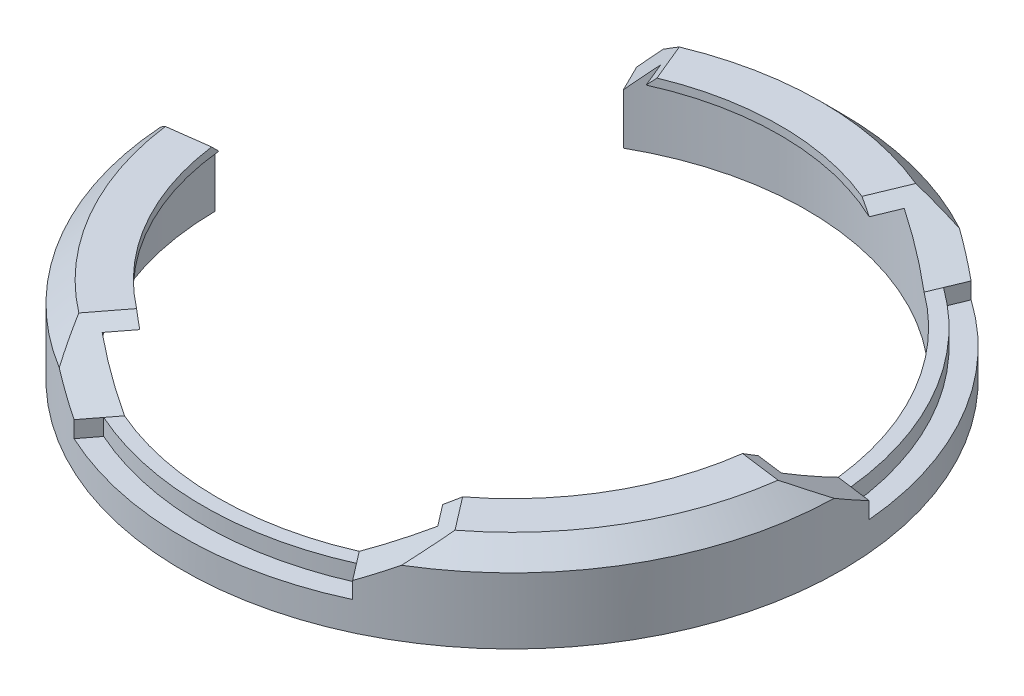
ISO-10303-21;
HEADER;
FILE_DESCRIPTION(('STEP AP214'),'2;1');
FILE_NAME('part.step','',(''),(''),'','','');
FILE_SCHEMA(('AUTOMOTIVE_DESIGN { 1 0 10303 214 1 1 1 1 }'));
ENDSEC;
DATA;
#1=APPLICATION_CONTEXT('core data for automotive mechanical design processes');
#2=APPLICATION_PROTOCOL_DEFINITION('international standard','automotive_design',2000,#1);
#3=PRODUCT_CONTEXT('',#1,'mechanical');
#4=PRODUCT('Part','Part','',(#3));
#5=PRODUCT_RELATED_PRODUCT_CATEGORY('part','',(#4));
#6=PRODUCT_DEFINITION_FORMATION('','',#4);
#7=PRODUCT_DEFINITION_CONTEXT('part definition',#1,'design');
#8=PRODUCT_DEFINITION('design','',#6,#7);
#9=PRODUCT_DEFINITION_SHAPE('','',#8);
#10=(LENGTH_UNIT() NAMED_UNIT(*) SI_UNIT(.MILLI.,.METRE.));
#11=(NAMED_UNIT(*) PLANE_ANGLE_UNIT() SI_UNIT($,.RADIAN.));
#12=(NAMED_UNIT(*) SI_UNIT($,.STERADIAN.) SOLID_ANGLE_UNIT());
#13=UNCERTAINTY_MEASURE_WITH_UNIT(LENGTH_MEASURE(1.E-05),#10,'distance_accuracy_value','');
#14=(GEOMETRIC_REPRESENTATION_CONTEXT(3) GLOBAL_UNCERTAINTY_ASSIGNED_CONTEXT((#13)) GLOBAL_UNIT_ASSIGNED_CONTEXT((#10,
#11,#12)) REPRESENTATION_CONTEXT('',''));
#15=CARTESIAN_POINT('',(0.,0.,0.));
#16=DIRECTION('',(0.,0.,1.));
#17=DIRECTION('',(1.,0.,0.));
#18=AXIS2_PLACEMENT_3D('',#15,#16,#17);
#19=CARTESIAN_POINT('',(0.,11.,0.));
#20=DIRECTION('',(0.,1.,0.));
#21=DIRECTION('',(0.,0.,1.));
#22=AXIS2_PLACEMENT_3D('',#19,#20,#21);
#23=PLANE('',#22);
#24=DIRECTION('',(0.991444861373811,0.,0.130526192220051));
#25=VECTOR('',#24,1.);
#26=CARTESIAN_POINT('',(2.26077996643632,11.,-17.1723287280254));
#27=LINE('',#26,#25);
#28=CARTESIAN_POINT('',(71.0376894548669,11.,-8.11767681753134));
#29=VERTEX_POINT('',#28);
#30=CARTESIAN_POINT('',(74.6090868747161,11.,-7.64749342733103));
#31=VERTEX_POINT('',#30);
#32=EDGE_CURVE('E199',#29,#31,#27,.T.);
#33=ORIENTED_EDGE('',*,*,#32,.T.);
#34=CARTESIAN_POINT('',(0.,11.,0.));
#35=DIRECTION('',(0.,1.,0.));
#36=DIRECTION('',(0.,0.,1.));
#37=AXIS2_PLACEMENT_3D('',#34,#35,#36);
#38=CIRCLE('',#37,75.);
#39=CARTESIAN_POINT('',(43.9274670207012,11.,-60.7896178729987));
#40=VERTEX_POINT('',#39);
#41=EDGE_CURVE('E338',#31,#40,#38,.T.);
#42=ORIENTED_EDGE('',*,*,#41,.T.);
#43=DIRECTION('',(-0.38268343236509,0.,0.923879532511287));
#44=VECTOR('',#43,1.);
#45=CARTESIAN_POINT('',(43.3639283179295,11.,-59.429115093845));
#46=LINE('',#45,#44);
#47=CARTESIAN_POINT('',(42.5489590711276,11.,-57.461605285299));
#48=VERTEX_POINT('',#47);
#49=EDGE_CURVE('E202',#40,#48,#46,.T.);
#50=ORIENTED_EDGE('',*,*,#49,.T.);
#51=CARTESIAN_POINT('',(0.,11.,0.));
#52=DIRECTION('',(0.,1.,0.));
#53=DIRECTION('',(0.,0.,1.));
#54=AXIS2_PLACEMENT_3D('',#51,#52,#53);
#55=CIRCLE('',#54,71.5);
#56=EDGE_CURVE('E184',#29,#48,#55,.T.);
#57=ORIENTED_EDGE('',*,*,#56,.F.);
#58=EDGE_LOOP('',(#33,#42,#50,#57));
#59=FACE_BOUND('',#58,.T.);
#60=ADVANCED_FACE('F37',(#59),#23,.T.);
#61=CARTESIAN_POINT('',(0.,11.,0.));
#62=DIRECTION('',(0.,1.,0.));
#63=DIRECTION('',(0.,0.,1.));
#64=AXIS2_PLACEMENT_3D('',#61,#62,#63);
#65=PLANE('',#64);
#66=DIRECTION('',(-0.60876142900872,0.,0.793353340291236));
#67=VECTOR('',#66,1.);
#68=CARTESIAN_POINT('',(13.7412829373892,11.,10.5440572473135));
#69=LINE('',#68,#67);
#70=CARTESIAN_POINT('',(-28.4887303837393,11.,65.5792821028304));
#71=VERTEX_POINT('',#70);
#72=CARTESIAN_POINT('',(-30.6816198540149,11.,68.4371113003297));
#73=VERTEX_POINT('',#72);
#74=EDGE_CURVE('E196',#71,#73,#69,.T.);
#75=ORIENTED_EDGE('',*,*,#74,.T.);
#76=CARTESIAN_POINT('',(0.,11.,0.));
#77=DIRECTION('',(0.,1.,0.));
#78=DIRECTION('',(0.,0.,1.));
#79=AXIS2_PLACEMENT_3D('',#76,#77,#78);
#80=CIRCLE('',#79,75.);
#81=CARTESIAN_POINT('',(30.6816198540148,11.,68.4371113003297));
#82=VERTEX_POINT('',#81);
#83=EDGE_CURVE('E343',#73,#82,#80,.T.);
#84=ORIENTED_EDGE('',*,*,#83,.T.);
#85=DIRECTION('',(-0.60876142900872,0.,-0.793353340291236));
#86=VECTOR('',#85,1.);
#87=CARTESIAN_POINT('',(29.7851592367343,11.,67.2688210781368));
#88=LINE('',#87,#86);
#89=CARTESIAN_POINT('',(28.4887303837394,11.,65.5792821028304));
#90=VERTEX_POINT('',#89);
#91=EDGE_CURVE('E192',#82,#90,#88,.T.);
#92=ORIENTED_EDGE('',*,*,#91,.T.);
#93=CARTESIAN_POINT('',(0.,11.,0.));
#94=DIRECTION('',(0.,1.,0.));
#95=DIRECTION('',(0.,0.,1.));
#96=AXIS2_PLACEMENT_3D('',#93,#94,#95);
#97=CIRCLE('',#96,71.5);
#98=EDGE_CURVE('E189',#71,#90,#97,.T.);
#99=ORIENTED_EDGE('',*,*,#98,.F.);
#100=EDGE_LOOP('',(#75,#84,#92,#99));
#101=FACE_BOUND('',#100,.T.);
#102=ADVANCED_FACE('F468',(#101),#65,.T.);
#103=CARTESIAN_POINT('',(0.,19.,0.));
#104=DIRECTION('',(0.,-1.,0.));
#105=DIRECTION('',(0.,0.,-1.));
#106=AXIS2_PLACEMENT_3D('',#103,#104,#105);
#107=CYLINDRICAL_SURFACE('',#106,80.);
#108=CARTESIAN_POINT('',(0.,0.,0.));
#109=DIRECTION('',(0.,1.,0.));
#110=DIRECTION('',(0.,0.,1.));
#111=AXIS2_PLACEMENT_3D('',#108,#109,#110);
#112=CIRCLE('',#111,80.);
#113=CARTESIAN_POINT('',(-79.9969538451337,0.,0.698122839869706));
#114=VERTEX_POINT('',#113);
#115=CARTESIAN_POINT('',(-39.3938848082776,0.,-69.6284556751919));
#116=VERTEX_POINT('',#115);
#117=EDGE_CURVE('E180',#114,#116,#112,.T.);
#118=ORIENTED_EDGE('',*,*,#117,.T.);
#119=DIRECTION('',(0.,1.,0.));
#120=VECTOR('',#119,1.);
#121=CARTESIAN_POINT('',(-39.3938848082776,-23.,-69.6284556751919));
#122=LINE('',#121,#120);
#123=CARTESIAN_POINT('',(-39.3938848082776,11.2504525275882,-69.6284556751919));
#124=VERTEX_POINT('',#123);
#125=EDGE_CURVE('E329',#116,#124,#122,.T.);
#126=ORIENTED_EDGE('',*,*,#125,.T.);
#127=CARTESIAN_POINT('',(0.,21.0000000000001,0.));
#128=DIRECTION('',(0.653281482438185,-0.707106781186551,-0.270598050073098));
#129=DIRECTION('',(-0.653281482438192,-0.707106781186544,0.2705980500731));
#130=AXIS2_PLACEMENT_3D('',#127,#128,#129);
#131=ELLIPSE('',#130,113.137084989847,80.);
#132=CARTESIAN_POINT('',(-35.1742194582713,16.,-71.8524480132818));
#133=VERTEX_POINT('',#132);
#134=EDGE_CURVE('E273',#124,#133,#131,.T.);
#135=ORIENTED_EDGE('',*,*,#134,.T.);
#136=CARTESIAN_POINT('',(0.,16.,0.));
#137=DIRECTION('',(0.,1.,0.));
#138=DIRECTION('',(0.,0.,1.));
#139=AXIS2_PLACEMENT_3D('',#136,#137,#138);
#140=CIRCLE('',#139,80.);
#141=CARTESIAN_POINT('',(38.4357945444284,15.9999999999999,-70.161882085207));
#142=VERTEX_POINT('',#141);
#143=EDGE_CURVE('E251',#133,#142,#140,.F.);
#144=ORIENTED_EDGE('',*,*,#143,.T.);
#145=CARTESIAN_POINT('',(0.,21.,0.));
#146=DIRECTION('',(0.461939766255639,0.866025403784441,0.191341716182543));
#147=DIRECTION('',(0.800103145191268,-0.499999999999995,0.331413574035593));
#148=AXIS2_PLACEMENT_3D('',#145,#146,#147);
#149=ELLIPSE('',#148,92.3760430703398,80.);
#150=CARTESIAN_POINT('',(45.8905944398684,11.,-65.5290267130187));
#151=VERTEX_POINT('',#150);
#152=EDGE_CURVE('E214',#142,#151,#149,.F.);
#153=ORIENTED_EDGE('',*,*,#152,.T.);
#154=DIRECTION('',(0.,1.,0.));
#155=VECTOR('',#154,1.);
#156=CARTESIAN_POINT('',(45.8905944398684,7.,-65.5290267130187));
#157=LINE('',#156,#155);
#158=CARTESIAN_POINT('',(45.8905944398684,7.,-65.5290267130187));
#159=VERTEX_POINT('',#158);
#160=EDGE_CURVE('E390',#159,#151,#157,.T.);
#161=ORIENTED_EDGE('',*,*,#160,.F.);
#162=CARTESIAN_POINT('',(0.,7.,0.));
#163=DIRECTION('',(0.,1.,0.));
#164=DIRECTION('',(0.,0.,1.));
#165=AXIS2_PLACEMENT_3D('',#162,#163,#164);
#166=CIRCLE('',#165,80.);
#167=CARTESIAN_POINT('',(79.6950990386775,7.,-6.97790722318564));
#168=VERTEX_POINT('',#167);
#169=EDGE_CURVE('E377',#168,#159,#166,.T.);
#170=ORIENTED_EDGE('',*,*,#169,.F.);
#171=DIRECTION('',(0.,1.,0.));
#172=VECTOR('',#171,1.);
#173=CARTESIAN_POINT('',(79.6950990386775,7.,-6.97790722318564));
#174=LINE('',#173,#172);
#175=CARTESIAN_POINT('',(79.6950990386775,11.,-6.97790722318564));
#176=VERTEX_POINT('',#175);
#177=EDGE_CURVE('E393',#168,#176,#174,.T.);
#178=ORIENTED_EDGE('',*,*,#177,.T.);
#179=CARTESIAN_POINT('',(0.,21.,0.));
#180=DIRECTION('',(-0.0652630961100247,-0.866025403784441,0.4957224306869));
#181=DIRECTION('',(0.113038998321815,-0.499999999999995,-0.858616436401264));
#182=AXIS2_PLACEMENT_3D('',#179,#180,#181);
#183=ELLIPSE('',#182,92.3760430703398,80.);
#184=CARTESIAN_POINT('',(79.9798695353317,16.,1.79456655248922));
#185=VERTEX_POINT('',#184);
#186=EDGE_CURVE('E235',#176,#185,#183,.T.);
#187=ORIENTED_EDGE('',*,*,#186,.T.);
#188=CARTESIAN_POINT('',(0.,16.,0.));
#189=DIRECTION('',(0.,1.,0.));
#190=DIRECTION('',(0.,0.,1.));
#191=AXIS2_PLACEMENT_3D('',#188,#189,#190);
#192=CIRCLE('',#191,80.);
#193=CARTESIAN_POINT('',(41.5440749909034,16.,68.3673155327178));
#194=VERTEX_POINT('',#193);
#195=EDGE_CURVE('E247',#185,#194,#192,.F.);
#196=ORIENTED_EDGE('',*,*,#195,.T.);
#197=CARTESIAN_POINT('',(0.,21.,0.));
#198=DIRECTION('',(-0.396676670145614,0.866025403784441,0.304380714504357));
#199=DIRECTION('',(-0.687064146869453,-0.499999999999995,0.52720286236567));
#200=AXIS2_PLACEMENT_3D('',#197,#198,#199);
#201=ELLIPSE('',#200,92.3760430703398,80.);
#202=CARTESIAN_POINT('',(33.8045045988091,11.,72.5069339362043));
#203=VERTEX_POINT('',#202);
#204=EDGE_CURVE('E225',#194,#203,#201,.F.);
#205=ORIENTED_EDGE('',*,*,#204,.T.);
#206=DIRECTION('',(0.,1.,0.));
#207=VECTOR('',#206,1.);
#208=CARTESIAN_POINT('',(33.8045045988091,7.,72.5069339362043));
#209=LINE('',#208,#207);
#210=CARTESIAN_POINT('',(33.8045045988091,7.,72.5069339362043));
#211=VERTEX_POINT('',#210);
#212=EDGE_CURVE('E365',#211,#203,#209,.T.);
#213=ORIENTED_EDGE('',*,*,#212,.F.);
#214=CARTESIAN_POINT('',(0.,7.,0.));
#215=DIRECTION('',(0.,1.,0.));
#216=DIRECTION('',(0.,0.,1.));
#217=AXIS2_PLACEMENT_3D('',#214,#215,#216);
#218=CIRCLE('',#217,80.);
#219=CARTESIAN_POINT('',(-33.8045045988091,7.,72.5069339362043));
#220=VERTEX_POINT('',#219);
#221=EDGE_CURVE('E342',#220,#211,#218,.T.);
#222=ORIENTED_EDGE('',*,*,#221,.F.);
#223=DIRECTION('',(0.,1.,0.));
#224=VECTOR('',#223,1.);
#225=CARTESIAN_POINT('',(-33.8045045988091,7.,72.5069339362043));
#226=LINE('',#225,#224);
#227=CARTESIAN_POINT('',(-33.8045045988091,11.,72.5069339362043));
#228=VERTEX_POINT('',#227);
#229=EDGE_CURVE('E352',#220,#228,#226,.T.);
#230=ORIENTED_EDGE('',*,*,#229,.T.);
#231=CARTESIAN_POINT('',(0.,21.,0.));
#232=DIRECTION('',(-0.396676670145614,-0.866025403784441,-0.304380714504357));
#233=DIRECTION('',(0.687064146869453,-0.499999999999995,0.52720286236567));
#234=AXIS2_PLACEMENT_3D('',#231,#232,#233);
#235=ELLIPSE('',#234,92.3760430703398,80.);
#236=CARTESIAN_POINT('',(-41.5440749909034,15.9999999999999,68.3673155327178));
#237=VERTEX_POINT('',#236);
#238=EDGE_CURVE('E206',#228,#237,#235,.T.);
#239=ORIENTED_EDGE('',*,*,#238,.T.);
#240=CARTESIAN_POINT('',(0.,15.9999999999999,0.));
#241=DIRECTION('',(0.,1.,0.));
#242=DIRECTION('',(0.,0.,1.));
#243=AXIS2_PLACEMENT_3D('',#240,#241,#242);
#244=CIRCLE('',#243,80.);
#245=CARTESIAN_POINT('',(-79.8131550327384,15.9999999999999,5.46445639748908));
#246=VERTEX_POINT('',#245);
#247=EDGE_CURVE('E112',#237,#246,#244,.F.);
#248=ORIENTED_EDGE('',*,*,#247,.T.);
#249=CARTESIAN_POINT('',(0.,21.0000000000002,0.));
#250=DIRECTION('',(-0.0922959556412576,0.707106781186544,-0.701057384649982));
#251=DIRECTION('',(-0.0922959556412567,-0.707106781186551,-0.701057384649974));
#252=AXIS2_PLACEMENT_3D('',#249,#250,#251);
#253=ELLIPSE('',#252,113.137084989848,80.);
#254=CARTESIAN_POINT('',(-79.9969538451337,11.2504525275881,0.698122839869706));
#255=VERTEX_POINT('',#254);
#256=EDGE_CURVE('E108',#246,#255,#253,.F.);
#257=ORIENTED_EDGE('',*,*,#256,.T.);
#258=DIRECTION('',(0.,1.,0.));
#259=VECTOR('',#258,1.);
#260=CARTESIAN_POINT('',(-79.9969538451337,-23.,0.698122839869706));
#261=LINE('',#260,#259);
#262=EDGE_CURVE('E94',#114,#255,#261,.T.);
#263=ORIENTED_EDGE('',*,*,#262,.F.);
#264=EDGE_LOOP('',(#118,#126,#135,#144,#153,#161,#170,#178,#187,#196,#205,#213,#222,#230,#239,
#248,#257,#263));
#265=FACE_BOUND('',#264,.T.);
#266=ADVANCED_FACE('F109',(#265),#107,.T.);
#267=CARTESIAN_POINT('',(0.,19.,0.));
#268=DIRECTION('',(0.,-1.,0.));
#269=DIRECTION('',(0.,0.,-1.));
#270=AXIS2_PLACEMENT_3D('',#267,#268,#269);
#271=CYLINDRICAL_SURFACE('',#270,71.5);
#272=DIRECTION('',(0.,1.,0.));
#273=VECTOR('',#272,1.);
#274=CARTESIAN_POINT('',(-35.2082845473981,-23.,-62.2304322597027));
#275=LINE('',#274,#273);
#276=CARTESIAN_POINT('',(-35.2082845473981,0.,-62.2304322597027));
#277=VERTEX_POINT('',#276);
#278=CARTESIAN_POINT('',(-35.2082845473981,12.2863419465319,-62.2304322597027));
#279=VERTEX_POINT('',#278);
#280=EDGE_CURVE('E68',#277,#279,#275,.T.);
#281=ORIENTED_EDGE('',*,*,#280,.F.);
#282=CARTESIAN_POINT('',(0.,0.,0.));
#283=DIRECTION('',(0.,1.,0.));
#284=DIRECTION('',(0.,0.,1.));
#285=AXIS2_PLACEMENT_3D('',#282,#283,#284);
#286=CIRCLE('',#285,71.5);
#287=CARTESIAN_POINT('',(-71.4972774990882,0.,0.623947288133549));
#288=VERTEX_POINT('',#287);
#289=EDGE_CURVE('E173',#288,#277,#286,.T.);
#290=ORIENTED_EDGE('',*,*,#289,.F.);
#291=DIRECTION('',(0.,1.,0.));
#292=VECTOR('',#291,1.);
#293=CARTESIAN_POINT('',(-71.4972774990882,-23.,0.623947288133549));
#294=LINE('',#293,#292);
#295=CARTESIAN_POINT('',(-71.4972774990882,12.2863419465319,0.623947288133549));
#296=VERTEX_POINT('',#295);
#297=EDGE_CURVE('E88',#288,#296,#294,.T.);
#298=ORIENTED_EDGE('',*,*,#297,.T.);
#299=CARTESIAN_POINT('',(0.,21.0000000000002,0.));
#300=DIRECTION('',(-0.0922959556412576,0.707106781186544,-0.701057384649982));
#301=DIRECTION('',(-0.0922959556412567,-0.707106781186551,-0.701057384649974));
#302=AXIS2_PLACEMENT_3D('',#299,#300,#301);
#303=ELLIPSE('',#302,101.116269709677,71.5);
#304=CARTESIAN_POINT('',(-71.1216218223904,19.,7.34608122422345));
#305=VERTEX_POINT('',#304);
#306=EDGE_CURVE('E119',#296,#305,#303,.T.);
#307=ORIENTED_EDGE('',*,*,#306,.T.);
#308=CARTESIAN_POINT('',(0.,19.,0.));
#309=DIRECTION('',(0.,1.,0.));
#310=DIRECTION('',(0.,0.,1.));
#311=AXIS2_PLACEMENT_3D('',#308,#309,#310);
#312=CIRCLE('',#311,71.5);
#313=CARTESIAN_POINT('',(-40.727070698328,19.,58.7669610609005));
#314=VERTEX_POINT('',#313);
#315=EDGE_CURVE('E129',#305,#314,#312,.T.);
#316=ORIENTED_EDGE('',*,*,#315,.T.);
#317=CARTESIAN_POINT('',(0.,21.,0.));
#318=DIRECTION('',(-0.396676670145614,-0.866025403784441,-0.304380714504357));
#319=DIRECTION('',(0.687064146869453,-0.499999999999995,0.52720286236567));
#320=AXIS2_PLACEMENT_3D('',#317,#318,#319);
#321=ELLIPSE('',#320,82.5610884941162,71.5);
#322=EDGE_CURVE('E212',#314,#71,#321,.F.);
#323=ORIENTED_EDGE('',*,*,#322,.T.);
#324=ORIENTED_EDGE('',*,*,#98,.T.);
#325=CARTESIAN_POINT('',(0.,21.,0.));
#326=DIRECTION('',(-0.396676670145614,0.866025403784441,0.304380714504357));
#327=DIRECTION('',(-0.687064146869453,-0.499999999999995,0.52720286236567));
#328=AXIS2_PLACEMENT_3D('',#325,#326,#327);
#329=ELLIPSE('',#328,82.5610884941162,71.5);
#330=CARTESIAN_POINT('',(40.727070698328,19.,58.7669610609005));
#331=VERTEX_POINT('',#330);
#332=EDGE_CURVE('E228',#90,#331,#329,.T.);
#333=ORIENTED_EDGE('',*,*,#332,.T.);
#334=CARTESIAN_POINT('',(71.2572165311147,19.,5.88719731602661));
#335=VERTEX_POINT('',#334);
#336=EDGE_CURVE('E168',#331,#335,#312,.T.);
#337=ORIENTED_EDGE('',*,*,#336,.T.);
#338=CARTESIAN_POINT('',(0.,21.,0.));
#339=DIRECTION('',(-0.0652630961100247,-0.866025403784441,0.4957224306869));
#340=DIRECTION('',(0.113038998321815,-0.499999999999995,-0.858616436401264));
#341=AXIS2_PLACEMENT_3D('',#338,#339,#340);
#342=ELLIPSE('',#341,82.5610884941162,71.5);
#343=EDGE_CURVE('E242',#335,#29,#342,.F.);
#344=ORIENTED_EDGE('',*,*,#343,.T.);
#345=ORIENTED_EDGE('',*,*,#56,.T.);
#346=CARTESIAN_POINT('',(0.,21.,0.));
#347=DIRECTION('',(0.461939766255639,0.866025403784441,0.191341716182543));
#348=DIRECTION('',(0.800103145191268,-0.499999999999995,0.331413574035593));
#349=AXIS2_PLACEMENT_3D('',#346,#347,#348);
#350=ELLIPSE('',#349,82.5610884941162,71.5);
#351=CARTESIAN_POINT('',(30.5301458327867,19.,-64.6541583769271));
#352=VERTEX_POINT('',#351);
#353=EDGE_CURVE('E217',#48,#352,#350,.T.);
#354=ORIENTED_EDGE('',*,*,#353,.T.);
#355=CARTESIAN_POINT('',(-29.1989179527537,19.,-65.2661718686515));
#356=VERTEX_POINT('',#355);
#357=EDGE_CURVE('E78',#352,#356,#312,.T.);
#358=ORIENTED_EDGE('',*,*,#357,.T.);
#359=CARTESIAN_POINT('',(0.,21.0000000000001,0.));
#360=DIRECTION('',(0.653281482438185,-0.707106781186551,-0.270598050073098));
#361=DIRECTION('',(-0.653281482438192,-0.707106781186544,0.2705980500731));
#362=AXIS2_PLACEMENT_3D('',#359,#360,#361);
#363=ELLIPSE('',#362,101.116269709676,71.5);
#364=EDGE_CURVE('E307',#356,#279,#363,.F.);
#365=ORIENTED_EDGE('',*,*,#364,.T.);
#366=EDGE_LOOP('',(#281,#290,#298,#307,#316,#323,#324,#333,#337,#344,#345,#354,#358,#365));
#367=FACE_BOUND('',#366,.T.);
#368=ADVANCED_FACE('F325',(#367),#271,.F.);
#369=CARTESIAN_POINT('',(0.,19.,0.));
#370=DIRECTION('',(0.,1.,0.));
#371=DIRECTION('',(0.,0.,1.));
#372=AXIS2_PLACEMENT_3D('',#369,#370,#371);
#373=PLANE('',#372);
#374=ORIENTED_EDGE('',*,*,#336,.F.);
#375=DIRECTION('',(0.60876142900872,0.,0.793353340291235));
#376=VECTOR('',#375,1.);
#377=CARTESIAN_POINT('',(-2.74825658747782,19.,2.10881144946269));
#378=LINE('',#377,#376);
#379=CARTESIAN_POINT('',(36.7650029780343,19.,53.6034938788987));
#380=VERTEX_POINT('',#379);
#381=EDGE_CURVE('E230',#331,#380,#378,.F.);
#382=ORIENTED_EDGE('',*,*,#381,.T.);
#383=CARTESIAN_POINT('',(0.,19.,0.));
#384=DIRECTION('',(0.,1.,0.));
#385=DIRECTION('',(0.,0.,1.));
#386=AXIS2_PLACEMENT_3D('',#383,#384,#385);
#387=CIRCLE('',#386,65.);
#388=CARTESIAN_POINT('',(64.8044889197471,19.,5.03767960973891));
#389=VERTEX_POINT('',#388);
#390=EDGE_CURVE('E152',#380,#389,#387,.T.);
#391=ORIENTED_EDGE('',*,*,#390,.T.);
#392=DIRECTION('',(0.991444861373811,0.,0.130526192220051));
#393=VECTOR('',#392,1.);
#394=CARTESIAN_POINT('',(0.452155993287262,19.,-3.43446574560507));
#395=LINE('',#394,#393);
#396=EDGE_CURVE('E240',#389,#335,#395,.T.);
#397=ORIENTED_EDGE('',*,*,#396,.T.);
#398=EDGE_LOOP('',(#374,#382,#391,#397));
#399=FACE_BOUND('',#398,.T.);
#400=ADVANCED_FACE('F483',(#399),#373,.F.);
#401=CARTESIAN_POINT('',(-64.6744551542293,19.,6.49729562999784));
#402=VERTEX_POINT('',#401);
#403=CARTESIAN_POINT('',(-36.7650029780343,19.,53.6034938788987));
#404=VERTEX_POINT('',#403);
#405=EDGE_CURVE('E54',#402,#404,#387,.T.);
#406=ORIENTED_EDGE('',*,*,#405,.T.);
#407=DIRECTION('',(-0.60876142900872,0.,0.793353340291236));
#408=VECTOR('',#407,1.);
#409=CARTESIAN_POINT('',(2.74825658747781,19.,2.10881144946268));
#410=LINE('',#409,#408);
#411=EDGE_CURVE('E210',#404,#314,#410,.T.);
#412=ORIENTED_EDGE('',*,*,#411,.T.);
#413=ORIENTED_EDGE('',*,*,#315,.F.);
#414=DIRECTION('',(-0.99144486137381,0.,0.130526192220051));
#415=VECTOR('',#414,1.);
#416=CARTESIAN_POINT('',(-0.261052384440123,19.,-1.98288972274777));
#417=LINE('',#416,#415);
#418=EDGE_CURVE('E47',#305,#402,#417,.F.);
#419=ORIENTED_EDGE('',*,*,#418,.T.);
#420=EDGE_LOOP('',(#406,#412,#413,#419));
#421=FACE_BOUND('',#420,.T.);
#422=ADVANCED_FACE('F125',(#421),#373,.F.);
#423=CARTESIAN_POINT('',(28.0394859417127,19.,-58.6411734886376));
#424=VERTEX_POINT('',#423);
#425=CARTESIAN_POINT('',(-26.7104045056389,19.,-59.2583689544789));
#426=VERTEX_POINT('',#425);
#427=EDGE_CURVE('E157',#424,#426,#387,.T.);
#428=ORIENTED_EDGE('',*,*,#427,.T.);
#429=DIRECTION('',(-0.38268343236509,0.,-0.923879532511287));
#430=VECTOR('',#429,1.);
#431=CARTESIAN_POINT('',(-1.84775906502265,19.,0.765366864730214));
#432=LINE('',#431,#430);
#433=EDGE_CURVE('E308',#426,#356,#432,.T.);
#434=ORIENTED_EDGE('',*,*,#433,.T.);
#435=ORIENTED_EDGE('',*,*,#357,.F.);
#436=DIRECTION('',(0.38268343236509,0.,-0.923879532511287));
#437=VECTOR('',#436,1.);
#438=CARTESIAN_POINT('',(3.20041258076509,19.,1.32565429614238));
#439=LINE('',#438,#437);
#440=EDGE_CURVE('E219',#352,#424,#439,.F.);
#441=ORIENTED_EDGE('',*,*,#440,.T.);
#442=EDGE_LOOP('',(#428,#434,#435,#441));
#443=FACE_BOUND('',#442,.T.);
#444=ADVANCED_FACE('F413',(#443),#373,.F.);
#445=CARTESIAN_POINT('',(0.,21.,0.));
#446=DIRECTION('',(0.,-1.,0.));
#447=DIRECTION('',(0.,0.,-1.));
#448=AXIS2_PLACEMENT_3D('',#445,#446,#447);
#449=CYLINDRICAL_SURFACE('',#448,65.);
#450=ORIENTED_EDGE('',*,*,#390,.F.);
#451=CARTESIAN_POINT('',(0.,21.,0.));
#452=DIRECTION('',(-0.396676670145614,0.866025403784441,0.304380714504357));
#453=DIRECTION('',(-0.687064146869453,-0.499999999999995,0.52720286236567));
#454=AXIS2_PLACEMENT_3D('',#451,#452,#453);
#455=ELLIPSE('',#454,75.0555349946511,65.);
#456=CARTESIAN_POINT('',(39.5694928855668,21.,51.5679671189303));
#457=VERTEX_POINT('',#456);
#458=EDGE_CURVE('E233',#380,#457,#455,.T.);
#459=ORIENTED_EDGE('',*,*,#458,.T.);
#460=CARTESIAN_POINT('',(0.,21.,0.));
#461=DIRECTION('',(0.,1.,0.));
#462=DIRECTION('',(0.,0.,1.));
#463=AXIS2_PLACEMENT_3D('',#460,#461,#462);
#464=CIRCLE('',#463,65.);
#465=CARTESIAN_POINT('',(64.4439159892977,21.,8.48420249430329));
#466=VERTEX_POINT('',#465);
#467=EDGE_CURVE('E154',#457,#466,#464,.T.);
#468=ORIENTED_EDGE('',*,*,#467,.T.);
#469=CARTESIAN_POINT('',(0.,21.,0.));
#470=DIRECTION('',(-0.0652630961100247,-0.866025403784441,0.4957224306869));
#471=DIRECTION('',(0.113038998321815,-0.499999999999995,-0.858616436401264));
#472=AXIS2_PLACEMENT_3D('',#469,#470,#471);
#473=ELLIPSE('',#472,75.0555349946511,65.);
#474=EDGE_CURVE('E238',#466,#389,#473,.F.);
#475=ORIENTED_EDGE('',*,*,#474,.T.);
#476=EDGE_LOOP('',(#450,#459,#468,#475));
#477=FACE_BOUND('',#476,.T.);
#478=ADVANCED_FACE('F487',(#477),#449,.F.);
#479=CARTESIAN_POINT('',(-64.4439159892977,21.,8.48420249430334));
#480=VERTEX_POINT('',#479);
#481=CARTESIAN_POINT('',(-39.5694928855668,21.,51.5679671189303));
#482=VERTEX_POINT('',#481);
#483=EDGE_CURVE('E138',#480,#482,#464,.T.);
#484=ORIENTED_EDGE('',*,*,#483,.T.);
#485=CARTESIAN_POINT('',(0.,21.,0.));
#486=DIRECTION('',(-0.396676670145614,-0.866025403784441,-0.304380714504357));
#487=DIRECTION('',(0.687064146869453,-0.499999999999995,0.52720286236567));
#488=AXIS2_PLACEMENT_3D('',#485,#486,#487);
#489=ELLIPSE('',#488,75.0555349946511,65.);
#490=EDGE_CURVE('E208',#482,#404,#489,.F.);
#491=ORIENTED_EDGE('',*,*,#490,.T.);
#492=ORIENTED_EDGE('',*,*,#405,.F.);
#493=CARTESIAN_POINT('',(0.,21.0000000000002,0.));
#494=DIRECTION('',(-0.0922959556412576,0.707106781186544,-0.701057384649982));
#495=DIRECTION('',(-0.0922959556412567,-0.707106781186551,-0.701057384649974));
#496=AXIS2_PLACEMENT_3D('',#493,#494,#495);
#497=ELLIPSE('',#496,91.9238815542517,65.);
#498=EDGE_CURVE('E11',#402,#480,#497,.T.);
#499=ORIENTED_EDGE('',*,*,#498,.T.);
#500=EDGE_LOOP('',(#484,#491,#492,#499));
#501=FACE_BOUND('',#500,.T.);
#502=ADVANCED_FACE('F136',(#501),#449,.F.);
#503=CARTESIAN_POINT('',(24.8744231037309,21.,-60.0521696132336));
#504=VERTEX_POINT('',#503);
#505=CARTESIAN_POINT('',(-24.8744231037309,21.,-60.0521696132336));
#506=VERTEX_POINT('',#505);
#507=EDGE_CURVE('E151',#504,#506,#464,.T.);
#508=ORIENTED_EDGE('',*,*,#507,.T.);
#509=CARTESIAN_POINT('',(0.,21.0000000000001,0.));
#510=DIRECTION('',(0.653281482438185,-0.707106781186551,-0.270598050073098));
#511=DIRECTION('',(-0.653281482438192,-0.707106781186544,0.2705980500731));
#512=AXIS2_PLACEMENT_3D('',#509,#510,#511);
#513=ELLIPSE('',#512,91.9238815542507,65.);
#514=EDGE_CURVE('E284',#506,#426,#513,.F.);
#515=ORIENTED_EDGE('',*,*,#514,.T.);
#516=ORIENTED_EDGE('',*,*,#427,.F.);
#517=CARTESIAN_POINT('',(0.,21.,0.));
#518=DIRECTION('',(0.461939766255639,0.866025403784441,0.191341716182543));
#519=DIRECTION('',(0.800103145191268,-0.499999999999995,0.331413574035593));
#520=AXIS2_PLACEMENT_3D('',#517,#518,#519);
#521=ELLIPSE('',#520,75.0555349946511,65.);
#522=EDGE_CURVE('E222',#424,#504,#521,.T.);
#523=ORIENTED_EDGE('',*,*,#522,.T.);
#524=EDGE_LOOP('',(#508,#515,#516,#523));
#525=FACE_BOUND('',#524,.T.);
#526=ADVANCED_FACE('F316',(#525),#449,.F.);
#527=CARTESIAN_POINT('',(0.,21.,0.));
#528=DIRECTION('',(0.,1.,0.));
#529=DIRECTION('',(0.,0.,1.));
#530=AXIS2_PLACEMENT_3D('',#527,#528,#529);
#531=PLANE('',#530);
#532=DIRECTION('',(0.60876142900872,0.,0.793353340291235));
#533=VECTOR('',#532,1.);
#534=CARTESIAN_POINT('',(0.,21.,0.));
#535=LINE('',#534,#533);
#536=CARTESIAN_POINT('',(45.657107175654,21.,59.5015005218427));
#537=VERTEX_POINT('',#536);
#538=EDGE_CURVE('E400',#457,#537,#535,.T.);
#539=ORIENTED_EDGE('',*,*,#538,.T.);
#540=CARTESIAN_POINT('',(0.,21.,0.));
#541=DIRECTION('',(0.,1.,0.));
#542=DIRECTION('',(0.,0.,1.));
#543=AXIS2_PLACEMENT_3D('',#540,#541,#542);
#544=CIRCLE('',#543,75.);
#545=CARTESIAN_POINT('',(74.3583646030358,21.,9.7894644165038));
#546=VERTEX_POINT('',#545);
#547=EDGE_CURVE('E262',#537,#546,#544,.T.);
#548=ORIENTED_EDGE('',*,*,#547,.T.);
#549=DIRECTION('',(0.991444861373811,0.,0.130526192220051));
#550=VECTOR('',#549,1.);
#551=CARTESIAN_POINT('',(0.,21.,0.));
#552=LINE('',#551,#550);
#553=EDGE_CURVE('E402',#466,#546,#552,.T.);
#554=ORIENTED_EDGE('',*,*,#553,.F.);
#555=ORIENTED_EDGE('',*,*,#467,.F.);
#556=EDGE_LOOP('',(#539,#548,#554,#555));
#557=FACE_BOUND('',#556,.T.);
#558=ADVANCED_FACE('F479',(#557),#531,.T.);
#559=DIRECTION('',(-0.991444861373811,0.,0.130526192220051));
#560=VECTOR('',#559,1.);
#561=CARTESIAN_POINT('',(0.,21.,0.));
#562=LINE('',#561,#560);
#563=CARTESIAN_POINT('',(-74.3583646030358,21.,9.78946441650385));
#564=VERTEX_POINT('',#563);
#565=EDGE_CURVE('E133',#480,#564,#562,.T.);
#566=ORIENTED_EDGE('',*,*,#565,.T.);
#567=CARTESIAN_POINT('',(0.,21.,0.));
#568=DIRECTION('',(0.,1.,0.));
#569=DIRECTION('',(0.,0.,1.));
#570=AXIS2_PLACEMENT_3D('',#567,#568,#569);
#571=CIRCLE('',#570,75.);
#572=CARTESIAN_POINT('',(-45.657107175654,21.,59.5015005218427));
#573=VERTEX_POINT('',#572);
#574=EDGE_CURVE('E257',#564,#573,#571,.T.);
#575=ORIENTED_EDGE('',*,*,#574,.T.);
#576=DIRECTION('',(-0.60876142900872,0.,0.793353340291236));
#577=VECTOR('',#576,1.);
#578=CARTESIAN_POINT('',(0.,21.,0.));
#579=LINE('',#578,#577);
#580=EDGE_CURVE('E150',#482,#573,#579,.T.);
#581=ORIENTED_EDGE('',*,*,#580,.F.);
#582=ORIENTED_EDGE('',*,*,#483,.F.);
#583=EDGE_LOOP('',(#566,#575,#581,#582));
#584=FACE_BOUND('',#583,.T.);
#585=ADVANCED_FACE('F145',(#584),#531,.T.);
#586=DIRECTION('',(0.38268343236509,0.,-0.923879532511287));
#587=VECTOR('',#586,1.);
#588=CARTESIAN_POINT('',(0.,21.,0.));
#589=LINE('',#588,#587);
#590=CARTESIAN_POINT('',(28.7012574273818,21.,-69.2909649383465));
#591=VERTEX_POINT('',#590);
#592=EDGE_CURVE('E407',#504,#591,#589,.T.);
#593=ORIENTED_EDGE('',*,*,#592,.T.);
#594=CARTESIAN_POINT('',(0.,21.,0.));
#595=DIRECTION('',(0.,1.,0.));
#596=DIRECTION('',(0.,0.,1.));
#597=AXIS2_PLACEMENT_3D('',#594,#595,#596);
#598=CIRCLE('',#597,75.);
#599=CARTESIAN_POINT('',(-28.7012574273818,21.,-69.2909649383465));
#600=VERTEX_POINT('',#599);
#601=EDGE_CURVE('E244',#591,#600,#598,.T.);
#602=ORIENTED_EDGE('',*,*,#601,.T.);
#603=DIRECTION('',(-0.38268343236509,0.,-0.923879532511287));
#604=VECTOR('',#603,1.);
#605=CARTESIAN_POINT('',(0.,21.,0.));
#606=LINE('',#605,#604);
#607=EDGE_CURVE('E399',#506,#600,#606,.T.);
#608=ORIENTED_EDGE('',*,*,#607,.F.);
#609=ORIENTED_EDGE('',*,*,#507,.F.);
#610=EDGE_LOOP('',(#593,#602,#608,#609));
#611=FACE_BOUND('',#610,.T.);
#612=ADVANCED_FACE('F424',(#611),#531,.T.);
#613=CARTESIAN_POINT('',(0.,0.,0.));
#614=DIRECTION('',(0.,1.,0.));
#615=DIRECTION('',(0.,0.,1.));
#616=AXIS2_PLACEMENT_3D('',#613,#614,#615);
#617=PLANE('',#616);
#618=ORIENTED_EDGE('',*,*,#289,.T.);
#619=DIRECTION('',(-0.49242356010347,0.,-0.870355695939898));
#620=VECTOR('',#619,1.);
#621=CARTESIAN_POINT('',(0.,0.,0.));
#622=LINE('',#621,#620);
#623=EDGE_CURVE('E336',#277,#116,#622,.T.);
#624=ORIENTED_EDGE('',*,*,#623,.T.);
#625=ORIENTED_EDGE('',*,*,#117,.F.);
#626=DIRECTION('',(0.999961923064171,0.,-0.00872653549837132));
#627=VECTOR('',#626,1.);
#628=CARTESIAN_POINT('',(0.,0.,0.));
#629=LINE('',#628,#627);
#630=EDGE_CURVE('E102',#114,#288,#629,.T.);
#631=ORIENTED_EDGE('',*,*,#630,.T.);
#632=EDGE_LOOP('',(#618,#624,#625,#631));
#633=FACE_BOUND('',#632,.T.);
#634=ADVANCED_FACE('F492',(#633),#617,.F.);
#635=CARTESIAN_POINT('',(13.7412829373892,11.,10.5440572473135));
#636=DIRECTION('',(-0.396676670145614,-0.866025403784441,-0.304380714504357));
#637=DIRECTION('',(-0.60876142900872,0.,0.793353340291236));
#638=AXIS2_PLACEMENT_3D('',#635,#636,#637);
#639=PLANE('',#638);
#640=ORIENTED_EDGE('',*,*,#580,.T.);
#641=CARTESIAN_POINT('',(51.5298110152069,-16.4999999999981,39.5402146774236));
#642=DIRECTION('',(-0.396676670145614,-0.866025403784441,-0.304380714504357));
#643=DIRECTION('',(0.687064146869453,-0.499999999999995,0.52720286236567));
#644=AXIS2_PLACEMENT_3D('',#641,#642,#643);
#645=ELLIPSE('',#644,129.903810567663,91.8558653543683);
#646=EDGE_CURVE('E259',#573,#237,#645,.F.);
#647=ORIENTED_EDGE('',*,*,#646,.T.);
#648=ORIENTED_EDGE('',*,*,#238,.F.);
#649=DIRECTION('',(-0.60876142900872,0.,0.793353340291235));
#650=VECTOR('',#649,1.);
#651=CARTESIAN_POINT('',(13.7412829373892,11.,10.5440572473135));
#652=LINE('',#651,#650);
#653=EDGE_CURVE('E353',#73,#228,#652,.T.);
#654=ORIENTED_EDGE('',*,*,#653,.F.);
#655=ORIENTED_EDGE('',*,*,#74,.F.);
#656=ORIENTED_EDGE('',*,*,#322,.F.);
#657=ORIENTED_EDGE('',*,*,#411,.F.);
#658=ORIENTED_EDGE('',*,*,#490,.F.);
#659=EDGE_LOOP('',(#640,#647,#648,#654,#655,#656,#657,#658));
#660=FACE_BOUND('',#659,.T.);
#661=ADVANCED_FACE('F495',(#660),#639,.F.);
#662=CARTESIAN_POINT('',(0.,21.,0.));
#663=DIRECTION('',(0.461939766255639,0.866025403784441,0.191341716182543));
#664=DIRECTION('',(-0.38268343236509,0.,0.923879532511287));
#665=AXIS2_PLACEMENT_3D('',#662,#663,#664);
#666=PLANE('',#665);
#667=ORIENTED_EDGE('',*,*,#152,.F.);
#668=CARTESIAN_POINT('',(60.0077358893433,-16.4999999999985,24.8560180526688));
#669=DIRECTION('',(0.461939766255639,0.866025403784441,0.191341716182543));
#670=DIRECTION('',(0.800103145191268,-0.499999999999995,0.331413574035593));
#671=AXIS2_PLACEMENT_3D('',#668,#669,#670);
#672=ELLIPSE('',#671,129.903810567664,91.8558653543685);
#673=EDGE_CURVE('E254',#142,#591,#672,.T.);
#674=ORIENTED_EDGE('',*,*,#673,.T.);
#675=ORIENTED_EDGE('',*,*,#592,.F.);
#676=ORIENTED_EDGE('',*,*,#522,.F.);
#677=ORIENTED_EDGE('',*,*,#440,.F.);
#678=ORIENTED_EDGE('',*,*,#353,.F.);
#679=ORIENTED_EDGE('',*,*,#49,.F.);
#680=EDGE_CURVE('E203',#151,#40,#46,.T.);
#681=ORIENTED_EDGE('',*,*,#680,.F.);
#682=EDGE_LOOP('',(#667,#674,#675,#676,#677,#678,#679,#681));
#683=FACE_BOUND('',#682,.T.);
#684=ADVANCED_FACE('F422',(#683),#666,.T.);
#685=CARTESIAN_POINT('',(0.,21.,0.));
#686=DIRECTION('',(-0.396676670145614,0.866025403784441,0.304380714504357));
#687=DIRECTION('',(-0.60876142900872,0.,-0.793353340291236));
#688=AXIS2_PLACEMENT_3D('',#685,#686,#687);
#689=PLANE('',#688);
#690=ORIENTED_EDGE('',*,*,#204,.F.);
#691=CARTESIAN_POINT('',(-51.5298110152069,-16.4999999999982,39.5402146774238));
#692=DIRECTION('',(-0.396676670145614,0.866025403784441,0.304380714504357));
#693=DIRECTION('',(-0.687064146869453,-0.499999999999995,0.52720286236567));
#694=AXIS2_PLACEMENT_3D('',#691,#692,#693);
#695=ELLIPSE('',#694,129.903810567663,91.8558653543684);
#696=EDGE_CURVE('E268',#194,#537,#695,.T.);
#697=ORIENTED_EDGE('',*,*,#696,.T.);
#698=ORIENTED_EDGE('',*,*,#538,.F.);
#699=ORIENTED_EDGE('',*,*,#458,.F.);
#700=ORIENTED_EDGE('',*,*,#381,.F.);
#701=ORIENTED_EDGE('',*,*,#332,.F.);
#702=ORIENTED_EDGE('',*,*,#91,.F.);
#703=EDGE_CURVE('E193',#203,#82,#88,.T.);
#704=ORIENTED_EDGE('',*,*,#703,.F.);
#705=EDGE_LOOP('',(#690,#697,#698,#699,#700,#701,#702,#704));
#706=FACE_BOUND('',#705,.T.);
#707=ADVANCED_FACE('F502',(#706),#689,.T.);
#708=CARTESIAN_POINT('',(2.26077996643632,11.,-17.1723287280254));
#709=DIRECTION('',(-0.0652630961100247,-0.866025403784441,0.4957224306869));
#710=DIRECTION('',(0.991444861373811,0.,0.130526192220051));
#711=AXIS2_PLACEMENT_3D('',#708,#709,#710);
#712=PLANE('',#711);
#713=ORIENTED_EDGE('',*,*,#553,.T.);
#714=CARTESIAN_POINT('',(8.47792487413578,-16.4999999999981,-64.3962327300922));
#715=DIRECTION('',(-0.0652630961100247,-0.866025403784441,0.4957224306869));
#716=DIRECTION('',(0.113038998321815,-0.499999999999995,-0.858616436401264));
#717=AXIS2_PLACEMENT_3D('',#714,#715,#716);
#718=ELLIPSE('',#717,129.903810567663,91.8558653543683);
#719=EDGE_CURVE('E265',#546,#185,#718,.F.);
#720=ORIENTED_EDGE('',*,*,#719,.T.);
#721=ORIENTED_EDGE('',*,*,#186,.F.);
#722=DIRECTION('',(0.991444861373811,0.,0.130526192220051));
#723=VECTOR('',#722,1.);
#724=CARTESIAN_POINT('',(2.26077996643632,11.,-17.1723287280254));
#725=LINE('',#724,#723);
#726=EDGE_CURVE('E374',#31,#176,#725,.T.);
#727=ORIENTED_EDGE('',*,*,#726,.F.);
#728=ORIENTED_EDGE('',*,*,#32,.F.);
#729=ORIENTED_EDGE('',*,*,#343,.F.);
#730=ORIENTED_EDGE('',*,*,#396,.F.);
#731=ORIENTED_EDGE('',*,*,#474,.F.);
#732=EDGE_LOOP('',(#713,#720,#721,#727,#728,#729,#730,#731));
#733=FACE_BOUND('',#732,.T.);
#734=ADVANCED_FACE('F295',(#733),#712,.F.);
#735=CARTESIAN_POINT('',(0.,21.,0.));
#736=DIRECTION('',(0.,-1.,0.));
#737=DIRECTION('',(0.,0.,-1.));
#738=AXIS2_PLACEMENT_3D('',#735,#736,#737);
#739=CONICAL_SURFACE('',#738,75.,0.785398163397448);
#740=ORIENTED_EDGE('',*,*,#673,.F.);
#741=ORIENTED_EDGE('',*,*,#143,.F.);
#742=CARTESIAN_POINT('',(-35.1742194582713,16.,-71.8524480132818));
#743=CARTESIAN_POINT('',(-34.634283960774,16.4207237145416,-71.6483324601481));
#744=CARTESIAN_POINT('',(-34.0944518015746,16.8404928088835,-71.4419718449371));
#745=CARTESIAN_POINT('',(-33.015058062262,17.6780147888408,-71.0246352429125));
#746=CARTESIAN_POINT('',(-32.4754964692896,18.0957677804595,-70.8136595020534));
#747=CARTESIAN_POINT('',(-31.3966480386551,18.9291971227323,-70.3869448139805));
#748=CARTESIAN_POINT('',(-30.8573612021789,19.3448734644913,-70.1712058463855));
#749=CARTESIAN_POINT('',(-29.779075875705,20.1740772340521,-69.7348086583925));
#750=CARTESIAN_POINT('',(-29.2400774025629,20.5876045464245,-69.5141501770559));
#751=CARTESIAN_POINT('',(-28.7012574273817,21.0000000000001,-69.2909649383464));
#752=B_SPLINE_CURVE_WITH_KNOTS('',3,(#742,#743,#744,#745,#746,#747,#748,#749,#750,#751),
.UNSPECIFIED.,.F.,.F.,(4,2,2,2,4),(0.,2.14285014132586,4.28558636028562,6.42833174955045,
8.57119106508105),.UNSPECIFIED.);
#753=EDGE_CURVE('E276',#133,#600,#752,.T.);
#754=ORIENTED_EDGE('',*,*,#753,.T.);
#755=ORIENTED_EDGE('',*,*,#601,.F.);
#756=EDGE_LOOP('',(#740,#741,#754,#755));
#757=FACE_BOUND('',#756,.T.);
#758=ADVANCED_FACE('F289',(#757),#739,.T.);
#759=CARTESIAN_POINT('',(0.,21.,0.));
#760=DIRECTION('',(0.,-1.,0.));
#761=DIRECTION('',(0.,0.,-1.));
#762=AXIS2_PLACEMENT_3D('',#759,#760,#761);
#763=CONICAL_SURFACE('',#762,75.,0.785398163397446);
#764=ORIENTED_EDGE('',*,*,#574,.F.);
#765=CARTESIAN_POINT('',(-74.3583646030356,21.0000000000002,9.78946441650383));
#766=CARTESIAN_POINT('',(-74.8210586770983,20.5876045464246,9.4344252492852));
#767=CARTESIAN_POINT('',(-75.2816537640674,20.1740772340521,9.0779681196114));
#768=CARTESIAN_POINT('',(-76.1987274782463,19.3448734644913,8.36234422835355));
#769=CARTESIAN_POINT('',(-76.655206323008,18.9291971227323,8.00317761183609));
#770=CARTESIAN_POINT('',(-77.5641762983642,18.0957677804595,7.2822248081101));
#771=CARTESIAN_POINT('',(-78.0166674460167,17.6780147888408,6.92043863211911));
#772=CARTESIAN_POINT('',(-78.9177884149555,16.8404928088835,6.19432453420086));
#773=CARTESIAN_POINT('',(-79.3664180296684,16.4207237145416,5.82999647815983));
#774=CARTESIAN_POINT('',(-79.8131550327384,15.9999999999999,5.46445639748909));
#775=B_SPLINE_CURVE_WITH_KNOTS('',3,(#765,#766,#767,#768,#769,#770,#771,#772,#773,#774),
.UNSPECIFIED.,.F.,.F.,(4,2,2,2,4),(0.,2.14285931553063,4.28560470479548,6.42834092375526,
8.57119106508116),.UNSPECIFIED.);
#776=EDGE_CURVE('E116',#564,#246,#775,.T.);
#777=ORIENTED_EDGE('',*,*,#776,.T.);
#778=ORIENTED_EDGE('',*,*,#247,.F.);
#779=ORIENTED_EDGE('',*,*,#646,.F.);
#780=EDGE_LOOP('',(#764,#777,#778,#779));
#781=FACE_BOUND('',#780,.T.);
#782=ADVANCED_FACE('F294',(#781),#763,.T.);
#783=CARTESIAN_POINT('',(0.,21.,0.));
#784=DIRECTION('',(0.,-1.,0.));
#785=DIRECTION('',(0.,0.,-1.));
#786=AXIS2_PLACEMENT_3D('',#783,#784,#785);
#787=CONICAL_SURFACE('',#786,75.,0.785398163397446);
#788=ORIENTED_EDGE('',*,*,#696,.F.);
#789=ORIENTED_EDGE('',*,*,#195,.F.);
#790=ORIENTED_EDGE('',*,*,#719,.F.);
#791=ORIENTED_EDGE('',*,*,#547,.F.);
#792=EDGE_LOOP('',(#788,#789,#790,#791));
#793=FACE_BOUND('',#792,.T.);
#794=ADVANCED_FACE('F300',(#793),#787,.T.);
#795=CARTESIAN_POINT('',(0.,7.,0.));
#796=DIRECTION('',(0.,1.,0.));
#797=DIRECTION('',(0.,0.,1.));
#798=AXIS2_PLACEMENT_3D('',#795,#796,#797);
#799=CYLINDRICAL_SURFACE('',#798,75.);
#800=ORIENTED_EDGE('',*,*,#41,.F.);
#801=DIRECTION('',(0.,1.,0.));
#802=VECTOR('',#801,1.);
#803=CARTESIAN_POINT('',(74.609086874716,7.,-7.64749342733104));
#804=LINE('',#803,#802);
#805=CARTESIAN_POINT('',(74.609086874716,7.,-7.64749342733104));
#806=VERTEX_POINT('',#805);
#807=EDGE_CURVE('E383',#806,#31,#804,.T.);
#808=ORIENTED_EDGE('',*,*,#807,.F.);
#809=CARTESIAN_POINT('',(0.,7.,0.));
#810=DIRECTION('',(0.,1.,0.));
#811=DIRECTION('',(0.,0.,1.));
#812=AXIS2_PLACEMENT_3D('',#809,#810,#811);
#813=CIRCLE('',#812,75.);
#814=CARTESIAN_POINT('',(43.9274670207012,7.,-60.7896178729987));
#815=VERTEX_POINT('',#814);
#816=EDGE_CURVE('E370',#806,#815,#813,.T.);
#817=ORIENTED_EDGE('',*,*,#816,.T.);
#818=DIRECTION('',(0.,1.,0.));
#819=VECTOR('',#818,1.);
#820=CARTESIAN_POINT('',(43.9274670207012,7.,-60.7896178729987));
#821=LINE('',#820,#819);
#822=EDGE_CURVE('E356',#815,#40,#821,.T.);
#823=ORIENTED_EDGE('',*,*,#822,.T.);
#824=EDGE_LOOP('',(#800,#808,#817,#823));
#825=FACE_BOUND('',#824,.T.);
#826=ADVANCED_FACE('F618',(#825),#799,.T.);
#827=CARTESIAN_POINT('',(16.0020629038255,7.,6.62827148071193));
#828=DIRECTION('',(-0.923879532511287,0.,-0.38268343236509));
#829=DIRECTION('',(-0.38268343236509,0.,0.923879532511287));
#830=AXIS2_PLACEMENT_3D('',#827,#828,#829);
#831=PLANE('',#830);
#832=ORIENTED_EDGE('',*,*,#680,.T.);
#833=ORIENTED_EDGE('',*,*,#822,.F.);
#834=DIRECTION('',(-0.38268343236509,0.,0.923879532511287));
#835=VECTOR('',#834,1.);
#836=CARTESIAN_POINT('',(16.0020629038255,7.,6.62827148071193));
#837=LINE('',#836,#835);
#838=EDGE_CURVE('E380',#159,#815,#837,.T.);
#839=ORIENTED_EDGE('',*,*,#838,.F.);
#840=ORIENTED_EDGE('',*,*,#160,.T.);
#841=EDGE_LOOP('',(#832,#833,#839,#840));
#842=FACE_BOUND('',#841,.T.);
#843=ADVANCED_FACE('F607',(#842),#831,.F.);
#844=CARTESIAN_POINT('',(2.26077996643632,7.,-17.1723287280254));
#845=DIRECTION('',(-0.130526192220051,0.,0.991444861373811));
#846=DIRECTION('',(0.991444861373811,0.,0.130526192220051));
#847=AXIS2_PLACEMENT_3D('',#844,#845,#846);
#848=PLANE('',#847);
#849=ORIENTED_EDGE('',*,*,#726,.T.);
#850=ORIENTED_EDGE('',*,*,#177,.F.);
#851=DIRECTION('',(0.991444861373811,0.,0.130526192220051));
#852=VECTOR('',#851,1.);
#853=CARTESIAN_POINT('',(2.26077996643632,7.,-17.1723287280254));
#854=LINE('',#853,#852);
#855=EDGE_CURVE('E373',#806,#168,#854,.T.);
#856=ORIENTED_EDGE('',*,*,#855,.F.);
#857=ORIENTED_EDGE('',*,*,#807,.T.);
#858=EDGE_LOOP('',(#849,#850,#856,#857));
#859=FACE_BOUND('',#858,.T.);
#860=ADVANCED_FACE('F616',(#859),#848,.F.);
#861=CARTESIAN_POINT('',(0.,7.,0.));
#862=DIRECTION('',(0.,1.,0.));
#863=DIRECTION('',(0.,0.,1.));
#864=AXIS2_PLACEMENT_3D('',#861,#862,#863);
#865=PLANE('',#864);
#866=ORIENTED_EDGE('',*,*,#816,.F.);
#867=ORIENTED_EDGE('',*,*,#855,.T.);
#868=ORIENTED_EDGE('',*,*,#169,.T.);
#869=ORIENTED_EDGE('',*,*,#838,.T.);
#870=EDGE_LOOP('',(#866,#867,#868,#869));
#871=FACE_BOUND('',#870,.T.);
#872=ADVANCED_FACE('F613',(#871),#865,.T.);
#873=CARTESIAN_POINT('',(13.7412829373892,7.,10.5440572473135));
#874=DIRECTION('',(-0.793353340291235,0.,-0.60876142900872));
#875=DIRECTION('',(-0.60876142900872,0.,0.793353340291235));
#876=AXIS2_PLACEMENT_3D('',#873,#874,#875);
#877=PLANE('',#876);
#878=ORIENTED_EDGE('',*,*,#653,.T.);
#879=ORIENTED_EDGE('',*,*,#229,.F.);
#880=DIRECTION('',(-0.60876142900872,0.,0.793353340291235));
#881=VECTOR('',#880,1.);
#882=CARTESIAN_POINT('',(13.7412829373892,7.,10.5440572473135));
#883=LINE('',#882,#881);
#884=CARTESIAN_POINT('',(-30.6816198540149,7.,68.4371113003297));
#885=VERTEX_POINT('',#884);
#886=EDGE_CURVE('E339',#885,#220,#883,.T.);
#887=ORIENTED_EDGE('',*,*,#886,.F.);
#888=DIRECTION('',(0.,1.,0.));
#889=VECTOR('',#888,1.);
#890=CARTESIAN_POINT('',(-30.6816198540149,7.,68.4371113003297));
#891=LINE('',#890,#889);
#892=EDGE_CURVE('E359',#885,#73,#891,.T.);
#893=ORIENTED_EDGE('',*,*,#892,.T.);
#894=EDGE_LOOP('',(#878,#879,#887,#893));
#895=FACE_BOUND('',#894,.T.);
#896=ADVANCED_FACE('F582',(#895),#877,.F.);
#897=CARTESIAN_POINT('',(0.,7.,0.));
#898=DIRECTION('',(0.,1.,0.));
#899=DIRECTION('',(0.,0.,1.));
#900=AXIS2_PLACEMENT_3D('',#897,#898,#899);
#901=CYLINDRICAL_SURFACE('',#900,75.);
#902=ORIENTED_EDGE('',*,*,#83,.F.);
#903=ORIENTED_EDGE('',*,*,#892,.F.);
#904=CARTESIAN_POINT('',(0.,7.,0.));
#905=DIRECTION('',(0.,1.,0.));
#906=DIRECTION('',(0.,0.,1.));
#907=AXIS2_PLACEMENT_3D('',#904,#905,#906);
#908=CIRCLE('',#907,75.);
#909=CARTESIAN_POINT('',(30.6816198540148,7.,68.4371113003297));
#910=VERTEX_POINT('',#909);
#911=EDGE_CURVE('E349',#885,#910,#908,.T.);
#912=ORIENTED_EDGE('',*,*,#911,.T.);
#913=DIRECTION('',(0.,1.,0.));
#914=VECTOR('',#913,1.);
#915=CARTESIAN_POINT('',(30.6816198540148,7.,68.4371113003297));
#916=LINE('',#915,#914);
#917=EDGE_CURVE('E362',#910,#82,#916,.T.);
#918=ORIENTED_EDGE('',*,*,#917,.T.);
#919=EDGE_LOOP('',(#902,#903,#912,#918));
#920=FACE_BOUND('',#919,.T.);
#921=ADVANCED_FACE('F593',(#920),#901,.T.);
#922=CARTESIAN_POINT('',(-13.7412829373894,7.,10.5440572473137));
#923=DIRECTION('',(0.793353340291233,0.,-0.608761429008724));
#924=DIRECTION('',(-0.608761429008724,0.,-0.793353340291233));
#925=AXIS2_PLACEMENT_3D('',#922,#923,#924);
#926=PLANE('',#925);
#927=ORIENTED_EDGE('',*,*,#703,.T.);
#928=ORIENTED_EDGE('',*,*,#917,.F.);
#929=DIRECTION('',(-0.608761429008723,0.,-0.793353340291233));
#930=VECTOR('',#929,1.);
#931=CARTESIAN_POINT('',(-13.7412829373894,7.,10.5440572473137));
#932=LINE('',#931,#930);
#933=EDGE_CURVE('E346',#211,#910,#932,.T.);
#934=ORIENTED_EDGE('',*,*,#933,.F.);
#935=ORIENTED_EDGE('',*,*,#212,.T.);
#936=EDGE_LOOP('',(#927,#928,#934,#935));
#937=FACE_BOUND('',#936,.T.);
#938=ADVANCED_FACE('F589',(#937),#926,.F.);
#939=CARTESIAN_POINT('',(0.,7.,0.));
#940=DIRECTION('',(0.,1.,0.));
#941=DIRECTION('',(0.,0.,1.));
#942=AXIS2_PLACEMENT_3D('',#939,#940,#941);
#943=PLANE('',#942);
#944=ORIENTED_EDGE('',*,*,#886,.T.);
#945=ORIENTED_EDGE('',*,*,#221,.T.);
#946=ORIENTED_EDGE('',*,*,#933,.T.);
#947=ORIENTED_EDGE('',*,*,#911,.F.);
#948=EDGE_LOOP('',(#944,#945,#946,#947));
#949=FACE_BOUND('',#948,.T.);
#950=ADVANCED_FACE('F465',(#949),#943,.T.);
#951=CARTESIAN_POINT('',(0.,-23.,0.));
#952=DIRECTION('',(0.00872653549837132,0.,0.999961923064171));
#953=DIRECTION('',(0.999961923064171,0.,-0.00872653549837132));
#954=AXIS2_PLACEMENT_3D('',#951,#952,#953);
#955=PLANE('',#954);
#956=ORIENTED_EDGE('',*,*,#262,.T.);
#957=DIRECTION('',(-0.992617843347829,-0.120974291151358,0.00866244468564202));
#958=VECTOR('',#957,1.);
#959=CARTESIAN_POINT('',(-5.28357455926053,20.3560697187389,0.0461090566412696));
#960=LINE('',#959,#958);
#961=EDGE_CURVE('E98',#255,#296,#960,.F.);
#962=ORIENTED_EDGE('',*,*,#961,.T.);
#963=ORIENTED_EDGE('',*,*,#297,.F.);
#964=ORIENTED_EDGE('',*,*,#630,.F.);
#965=EDGE_LOOP('',(#956,#962,#963,#964));
#966=FACE_BOUND('',#965,.T.);
#967=ADVANCED_FACE('F96',(#966),#955,.F.);
#968=CARTESIAN_POINT('',(0.,-23.,0.));
#969=DIRECTION('',(0.870355695939898,0.,-0.49242356010347));
#970=DIRECTION('',(-0.49242356010347,0.,-0.870355695939898));
#971=AXIS2_PLACEMENT_3D('',#968,#969,#970);
#972=PLANE('',#971);
#973=ORIENTED_EDGE('',*,*,#280,.T.);
#974=DIRECTION('',(-0.488807024517271,-0.120974291151356,-0.863963490931763));
#975=VECTOR('',#974,1.);
#976=CARTESIAN_POINT('',(-2.60185566523434,20.3560697187389,-4.59876431942932));
#977=LINE('',#976,#975);
#978=EDGE_CURVE('E271',#279,#124,#977,.T.);
#979=ORIENTED_EDGE('',*,*,#978,.T.);
#980=ORIENTED_EDGE('',*,*,#125,.F.);
#981=ORIENTED_EDGE('',*,*,#623,.F.);
#982=EDGE_LOOP('',(#973,#979,#980,#981));
#983=FACE_BOUND('',#982,.T.);
#984=ADVANCED_FACE('F458',(#983),#972,.F.);
#985=CARTESIAN_POINT('',(-9.23879532511302,11.,3.82683432365097));
#986=DIRECTION('',(0.653281482438185,-0.707106781186551,-0.270598050073098));
#987=DIRECTION('',(-0.38268343236509,0.,-0.923879532511287));
#988=AXIS2_PLACEMENT_3D('',#985,#986,#987);
#989=PLANE('',#988);
#990=ORIENTED_EDGE('',*,*,#514,.F.);
#991=ORIENTED_EDGE('',*,*,#607,.T.);
#992=ORIENTED_EDGE('',*,*,#753,.F.);
#993=ORIENTED_EDGE('',*,*,#134,.F.);
#994=ORIENTED_EDGE('',*,*,#978,.F.);
#995=ORIENTED_EDGE('',*,*,#364,.F.);
#996=ORIENTED_EDGE('',*,*,#433,.F.);
#997=EDGE_LOOP('',(#990,#991,#992,#993,#994,#995,#996));
#998=FACE_BOUND('',#997,.T.);
#999=ADVANCED_FACE('F286',(#998),#989,.F.);
#1000=CARTESIAN_POINT('',(0.,21.0000000000002,0.));
#1001=DIRECTION('',(-0.0922959556412576,0.707106781186544,-0.701057384649982));
#1002=DIRECTION('',(0.99144486137381,0.,-0.130526192220051));
#1003=AXIS2_PLACEMENT_3D('',#1000,#1001,#1002);
#1004=PLANE('',#1003);
#1005=ORIENTED_EDGE('',*,*,#306,.F.);
#1006=ORIENTED_EDGE('',*,*,#961,.F.);
#1007=ORIENTED_EDGE('',*,*,#256,.F.);
#1008=ORIENTED_EDGE('',*,*,#776,.F.);
#1009=ORIENTED_EDGE('',*,*,#565,.F.);
#1010=ORIENTED_EDGE('',*,*,#498,.F.);
#1011=ORIENTED_EDGE('',*,*,#418,.F.);
#1012=EDGE_LOOP('',(#1005,#1006,#1007,#1008,#1009,#1010,#1011));
#1013=FACE_BOUND('',#1012,.T.);
#1014=ADVANCED_FACE('F39',(#1013),#1004,.T.);
#1015=CLOSED_SHELL('',(#60,#102,#266,#368,#400,#422,#444,#478,#502,#526,#558,#585,#612,#634,
#661,#684,#707,#734,#758,#782,#794,#826,#843,#860,#872,#896,#921,#938,#950,#967,#984,#999,#1014));
#1016=MANIFOLD_SOLID_BREP('B2',#1015);
#1017=ADVANCED_BREP_SHAPE_REPRESENTATION('',(#18,#1016),#14);
#1018=SHAPE_DEFINITION_REPRESENTATION(#9,#1017);
ENDSEC;
END-ISO-10303-21;
